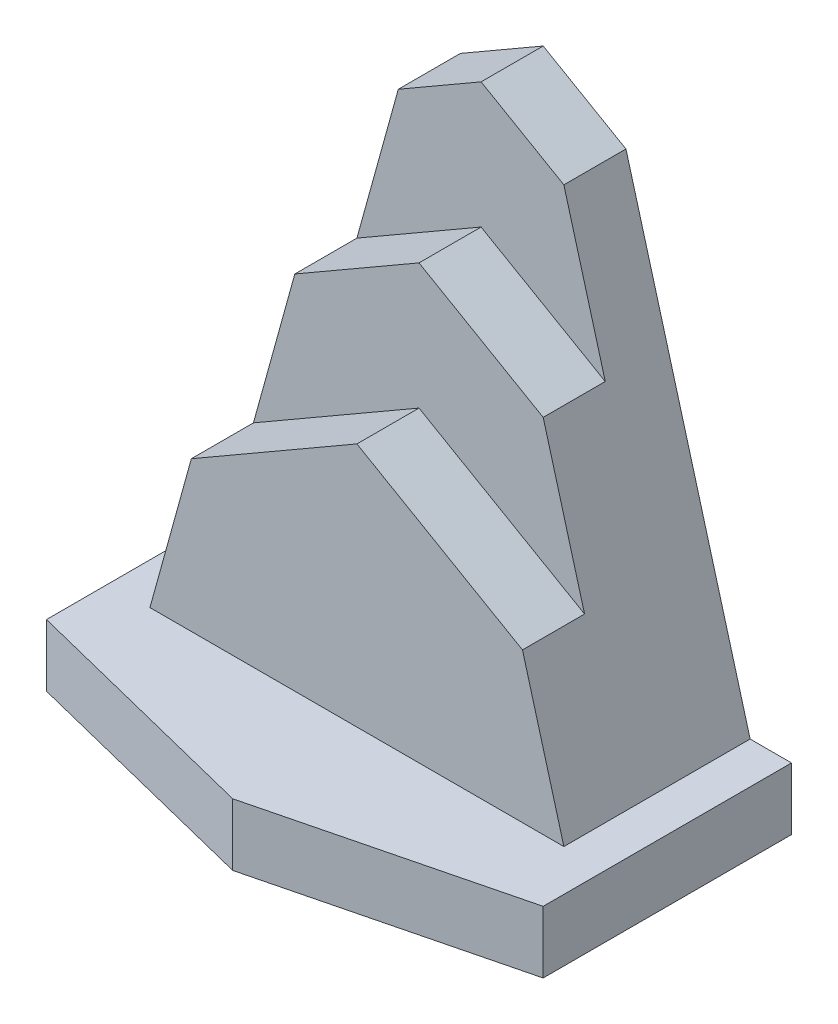
ISO-10303-21;
HEADER;
FILE_DESCRIPTION(('STEP AP214'),'2;1');
FILE_NAME('part.step','',(''),(''),'','','');
FILE_SCHEMA(('AUTOMOTIVE_DESIGN { 1 0 10303 214 1 1 1 1 }'));
ENDSEC;
DATA;
#1=APPLICATION_CONTEXT('core data for automotive mechanical design processes');
#2=APPLICATION_PROTOCOL_DEFINITION('international standard','automotive_design',2000,#1);
#3=PRODUCT_CONTEXT('',#1,'mechanical');
#4=PRODUCT('Part','Part','',(#3));
#5=PRODUCT_RELATED_PRODUCT_CATEGORY('part','',(#4));
#6=PRODUCT_DEFINITION_FORMATION('','',#4);
#7=PRODUCT_DEFINITION_CONTEXT('part definition',#1,'design');
#8=PRODUCT_DEFINITION('design','',#6,#7);
#9=PRODUCT_DEFINITION_SHAPE('','',#8);
#10=(LENGTH_UNIT() NAMED_UNIT(*) SI_UNIT(.MILLI.,.METRE.));
#11=(NAMED_UNIT(*) PLANE_ANGLE_UNIT() SI_UNIT($,.RADIAN.));
#12=(NAMED_UNIT(*) SI_UNIT($,.STERADIAN.) SOLID_ANGLE_UNIT());
#13=UNCERTAINTY_MEASURE_WITH_UNIT(LENGTH_MEASURE(1.E-05),#10,'distance_accuracy_value','');
#14=(GEOMETRIC_REPRESENTATION_CONTEXT(3) GLOBAL_UNCERTAINTY_ASSIGNED_CONTEXT((#13)) GLOBAL_UNIT_ASSIGNED_CONTEXT((#10,
#11,#12)) REPRESENTATION_CONTEXT('',''));
#15=CARTESIAN_POINT('',(0.,0.,0.));
#16=DIRECTION('',(0.,0.,1.));
#17=DIRECTION('',(1.,0.,0.));
#18=AXIS2_PLACEMENT_3D('',#15,#16,#17);
#19=CARTESIAN_POINT('',(0.,15.,-60.));
#20=DIRECTION('',(0.,1.,0.));
#21=DIRECTION('',(0.,0.,1.));
#22=AXIS2_PLACEMENT_3D('',#19,#20,#21);
#23=PLANE('',#22);
#24=DIRECTION('',(1.,0.,0.));
#25=VECTOR('',#24,1.);
#26=CARTESIAN_POINT('',(-110.,15.,-15.));
#27=LINE('',#26,#25);
#28=CARTESIAN_POINT('',(-110.,15.,-15.));
#29=VERTEX_POINT('',#28);
#30=CARTESIAN_POINT('',(-10.,15.,-15.));
#31=VERTEX_POINT('',#30);
#32=EDGE_CURVE('E161',#29,#31,#27,.T.);
#33=ORIENTED_EDGE('',*,*,#32,.F.);
#34=DIRECTION('',(0.,0.,-1.));
#35=VECTOR('',#34,1.);
#36=CARTESIAN_POINT('',(-110.,15.,-45.));
#37=LINE('',#36,#35);
#38=CARTESIAN_POINT('',(-110.,15.,-60.));
#39=VERTEX_POINT('',#38);
#40=EDGE_CURVE('E147',#29,#39,#37,.T.);
#41=ORIENTED_EDGE('',*,*,#40,.T.);
#42=DIRECTION('',(-1.,0.,0.));
#43=VECTOR('',#42,1.);
#44=CARTESIAN_POINT('',(-120.,15.,-60.));
#45=LINE('',#44,#43);
#46=CARTESIAN_POINT('',(-120.,15.,-60.));
#47=VERTEX_POINT('',#46);
#48=EDGE_CURVE('E251',#39,#47,#45,.T.);
#49=ORIENTED_EDGE('',*,*,#48,.T.);
#50=DIRECTION('',(0.,0.,1.));
#51=VECTOR('',#50,1.);
#52=CARTESIAN_POINT('',(-120.,15.,0.));
#53=LINE('',#52,#51);
#54=CARTESIAN_POINT('',(-120.,15.,0.));
#55=VERTEX_POINT('',#54);
#56=EDGE_CURVE('E250',#47,#55,#53,.T.);
#57=ORIENTED_EDGE('',*,*,#56,.T.);
#58=DIRECTION('',(0.970142500145332,0.,0.242535625036333));
#59=VECTOR('',#58,1.);
#60=CARTESIAN_POINT('',(-60.,15.,15.));
#61=LINE('',#60,#59);
#62=CARTESIAN_POINT('',(-60.,15.,15.));
#63=VERTEX_POINT('',#62);
#64=EDGE_CURVE('E253',#55,#63,#61,.T.);
#65=ORIENTED_EDGE('',*,*,#64,.T.);
#66=DIRECTION('',(0.970142500145332,0.,-0.242535625036333));
#67=VECTOR('',#66,1.);
#68=CARTESIAN_POINT('',(0.,15.,0.));
#69=LINE('',#68,#67);
#70=CARTESIAN_POINT('',(0.,15.,0.));
#71=VERTEX_POINT('',#70);
#72=EDGE_CURVE('E261',#63,#71,#69,.T.);
#73=ORIENTED_EDGE('',*,*,#72,.T.);
#74=DIRECTION('',(0.,0.,-1.));
#75=VECTOR('',#74,1.);
#76=CARTESIAN_POINT('',(0.,15.,-60.));
#77=LINE('',#76,#75);
#78=CARTESIAN_POINT('',(0.,15.,-60.));
#79=VERTEX_POINT('',#78);
#80=EDGE_CURVE('E231',#71,#79,#77,.T.);
#81=ORIENTED_EDGE('',*,*,#80,.T.);
#82=CARTESIAN_POINT('',(-9.99999999999999,15.,-60.));
#83=VERTEX_POINT('',#82);
#84=EDGE_CURVE('E244',#79,#83,#45,.T.);
#85=ORIENTED_EDGE('',*,*,#84,.T.);
#86=DIRECTION('',(0.,0.,-1.));
#87=VECTOR('',#86,1.);
#88=CARTESIAN_POINT('',(-9.99999999999999,15.,-45.));
#89=LINE('',#88,#87);
#90=EDGE_CURVE('E168',#31,#83,#89,.T.);
#91=ORIENTED_EDGE('',*,*,#90,.F.);
#92=EDGE_LOOP('',(#33,#41,#49,#57,#65,#73,#81,#85,#91));
#93=FACE_BOUND('',#92,.T.);
#94=ADVANCED_FACE('F33',(#93),#23,.T.);
#95=CARTESIAN_POINT('',(-60.,-46.6403925452972,-30.));
#96=DIRECTION('',(0.,0.,1.));
#97=DIRECTION('',(1.,0.,0.));
#98=AXIS2_PLACEMENT_3D('',#95,#96,#97);
#99=PLANE('',#98);
#100=DIRECTION('',(-0.866025403784438,-0.5,0.));
#101=VECTOR('',#100,1.);
#102=CARTESIAN_POINT('',(-60.0000000000001,74.2450089729875,-30.));
#103=LINE('',#102,#101);
#104=CARTESIAN_POINT('',(-60.0000000000001,74.2450089729875,-30.));
#105=VERTEX_POINT('',#104);
#106=CARTESIAN_POINT('',(-100.,51.1509982054026,-30.));
#107=VERTEX_POINT('',#106);
#108=EDGE_CURVE('E165',#105,#107,#103,.T.);
#109=ORIENTED_EDGE('',*,*,#108,.F.);
#110=DIRECTION('',(-0.866025403784439,0.5,0.));
#111=VECTOR('',#110,1.);
#112=CARTESIAN_POINT('',(-20.,51.1509982054024,-30.));
#113=LINE('',#112,#111);
#114=CARTESIAN_POINT('',(-20.,51.1509982054024,-30.));
#115=VERTEX_POINT('',#114);
#116=EDGE_CURVE('E177',#115,#105,#113,.T.);
#117=ORIENTED_EDGE('',*,*,#116,.F.);
#118=DIRECTION('',(-0.266605563289811,0.963805724004025,0.));
#119=VECTOR('',#118,1.);
#120=CARTESIAN_POINT('',(2.28494041244322,-29.4112858803711,-30.));
#121=LINE('',#120,#119);
#122=CARTESIAN_POINT('',(-30.,87.3019964108049,-30.));
#123=VERTEX_POINT('',#122);
#124=EDGE_CURVE('E195',#115,#123,#121,.T.);
#125=ORIENTED_EDGE('',*,*,#124,.T.);
#126=DIRECTION('',(0.866025403784439,-0.5,0.));
#127=VECTOR('',#126,1.);
#128=CARTESIAN_POINT('',(5.49875573978038,66.8067802285459,-30.));
#129=LINE('',#128,#127);
#130=CARTESIAN_POINT('',(-60.0000000000001,104.622504486494,-30.));
#131=VERTEX_POINT('',#130);
#132=EDGE_CURVE('E185',#131,#123,#129,.T.);
#133=ORIENTED_EDGE('',*,*,#132,.F.);
#134=DIRECTION('',(0.866025403784439,0.5,0.));
#135=VECTOR('',#134,1.);
#136=CARTESIAN_POINT('',(-125.49875573978,66.8067802285461,-30.));
#137=LINE('',#136,#135);
#138=CARTESIAN_POINT('',(-90.,87.301996410805,-30.));
#139=VERTEX_POINT('',#138);
#140=EDGE_CURVE('E188',#139,#131,#137,.T.);
#141=ORIENTED_EDGE('',*,*,#140,.F.);
#142=DIRECTION('',(-0.26660556328981,-0.963805724004025,0.));
#143=VECTOR('',#142,1.);
#144=CARTESIAN_POINT('',(-122.284940412443,-29.4112858803711,-30.));
#145=LINE('',#144,#143);
#146=EDGE_CURVE('E192',#139,#107,#145,.T.);
#147=ORIENTED_EDGE('',*,*,#146,.T.);
#148=EDGE_LOOP('',(#109,#117,#125,#133,#141,#147));
#149=FACE_BOUND('',#148,.T.);
#150=ADVANCED_FACE('F324',(#149),#99,.T.);
#151=CARTESIAN_POINT('',(0.,15.,-60.));
#152=DIRECTION('',(-1.,0.,0.));
#153=DIRECTION('',(0.,0.,1.));
#154=AXIS2_PLACEMENT_3D('',#151,#152,#153);
#155=PLANE('',#154);
#156=DIRECTION('',(0.,0.,-1.));
#157=VECTOR('',#156,1.);
#158=CARTESIAN_POINT('',(0.,0.,-60.));
#159=LINE('',#158,#157);
#160=CARTESIAN_POINT('',(0.,0.,0.));
#161=VERTEX_POINT('',#160);
#162=CARTESIAN_POINT('',(0.,0.,-60.));
#163=VERTEX_POINT('',#162);
#164=EDGE_CURVE('E238',#161,#163,#159,.T.);
#165=ORIENTED_EDGE('',*,*,#164,.T.);
#166=DIRECTION('',(0.,-1.,0.));
#167=VECTOR('',#166,1.);
#168=CARTESIAN_POINT('',(0.,15.,-60.));
#169=LINE('',#168,#167);
#170=EDGE_CURVE('E11',#79,#163,#169,.T.);
#171=ORIENTED_EDGE('',*,*,#170,.F.);
#172=ORIENTED_EDGE('',*,*,#80,.F.);
#173=DIRECTION('',(0.,-1.,0.));
#174=VECTOR('',#173,1.);
#175=CARTESIAN_POINT('',(0.,15.,0.));
#176=LINE('',#175,#174);
#177=EDGE_CURVE('E263',#71,#161,#176,.T.);
#178=ORIENTED_EDGE('',*,*,#177,.T.);
#179=EDGE_LOOP('',(#165,#171,#172,#178));
#180=FACE_BOUND('',#179,.T.);
#181=ADVANCED_FACE('F35',(#180),#155,.F.);
#182=CARTESIAN_POINT('',(-120.,15.,-60.));
#183=DIRECTION('',(0.,0.,1.));
#184=DIRECTION('',(1.,0.,0.));
#185=AXIS2_PLACEMENT_3D('',#182,#183,#184);
#186=PLANE('',#185);
#187=DIRECTION('',(-1.,0.,0.));
#188=VECTOR('',#187,1.);
#189=CARTESIAN_POINT('',(-120.,0.,-60.));
#190=LINE('',#189,#188);
#191=CARTESIAN_POINT('',(-120.,0.,-60.));
#192=VERTEX_POINT('',#191);
#193=EDGE_CURVE('E266',#163,#192,#190,.T.);
#194=ORIENTED_EDGE('',*,*,#193,.T.);
#195=DIRECTION('',(0.,-1.,0.));
#196=VECTOR('',#195,1.);
#197=CARTESIAN_POINT('',(-120.,15.,-60.));
#198=LINE('',#197,#196);
#199=EDGE_CURVE('E42',#47,#192,#198,.T.);
#200=ORIENTED_EDGE('',*,*,#199,.F.);
#201=ORIENTED_EDGE('',*,*,#48,.F.);
#202=DIRECTION('',(0.26660556328981,0.963805724004025,0.));
#203=VECTOR('',#202,1.);
#204=CARTESIAN_POINT('',(-110.,15.,-60.));
#205=LINE('',#204,#203);
#206=CARTESIAN_POINT('',(-80.,123.452994616208,-60.));
#207=VERTEX_POINT('',#206);
#208=EDGE_CURVE('E58',#39,#207,#205,.T.);
#209=ORIENTED_EDGE('',*,*,#208,.T.);
#210=DIRECTION('',(0.86602540378444,0.499999999999998,0.));
#211=VECTOR('',#210,1.);
#212=CARTESIAN_POINT('',(-80.,123.452994616208,-60.));
#213=LINE('',#212,#211);
#214=CARTESIAN_POINT('',(-60.,135.,-60.));
#215=VERTEX_POINT('',#214);
#216=EDGE_CURVE('E218',#207,#215,#213,.T.);
#217=ORIENTED_EDGE('',*,*,#216,.T.);
#218=DIRECTION('',(0.866025403784436,-0.500000000000004,0.));
#219=VECTOR('',#218,1.);
#220=CARTESIAN_POINT('',(-60.,135.,-60.));
#221=LINE('',#220,#219);
#222=CARTESIAN_POINT('',(-40.,123.452994616207,-60.));
#223=VERTEX_POINT('',#222);
#224=EDGE_CURVE('E221',#215,#223,#221,.T.);
#225=ORIENTED_EDGE('',*,*,#224,.T.);
#226=DIRECTION('',(0.266605563289811,-0.963805724004025,0.));
#227=VECTOR('',#226,1.);
#228=CARTESIAN_POINT('',(-40.,123.452994616207,-60.));
#229=LINE('',#228,#227);
#230=EDGE_CURVE('E210',#223,#83,#229,.T.);
#231=ORIENTED_EDGE('',*,*,#230,.T.);
#232=ORIENTED_EDGE('',*,*,#84,.F.);
#233=ORIENTED_EDGE('',*,*,#170,.T.);
#234=EDGE_LOOP('',(#194,#200,#201,#209,#217,#225,#231,#232,#233));
#235=FACE_BOUND('',#234,.T.);
#236=ADVANCED_FACE('F243',(#235),#186,.F.);
#237=CARTESIAN_POINT('',(-120.,15.,0.));
#238=DIRECTION('',(1.,0.,0.));
#239=DIRECTION('',(0.,0.,-1.));
#240=AXIS2_PLACEMENT_3D('',#237,#238,#239);
#241=PLANE('',#240);
#242=DIRECTION('',(0.,0.,1.));
#243=VECTOR('',#242,1.);
#244=CARTESIAN_POINT('',(-120.,0.,0.));
#245=LINE('',#244,#243);
#246=CARTESIAN_POINT('',(-120.,0.,0.));
#247=VERTEX_POINT('',#246);
#248=EDGE_CURVE('E268',#192,#247,#245,.T.);
#249=ORIENTED_EDGE('',*,*,#248,.T.);
#250=DIRECTION('',(0.,-1.,0.));
#251=VECTOR('',#250,1.);
#252=CARTESIAN_POINT('',(-120.,15.,0.));
#253=LINE('',#252,#251);
#254=EDGE_CURVE('E279',#55,#247,#253,.T.);
#255=ORIENTED_EDGE('',*,*,#254,.F.);
#256=ORIENTED_EDGE('',*,*,#56,.F.);
#257=ORIENTED_EDGE('',*,*,#199,.T.);
#258=EDGE_LOOP('',(#249,#255,#256,#257));
#259=FACE_BOUND('',#258,.T.);
#260=ADVANCED_FACE('F286',(#259),#241,.F.);
#261=CARTESIAN_POINT('',(-60.,15.,15.));
#262=DIRECTION('',(0.242535625036333,0.,-0.970142500145332));
#263=DIRECTION('',(-0.970142500145332,0.,-0.242535625036333));
#264=AXIS2_PLACEMENT_3D('',#261,#262,#263);
#265=PLANE('',#264);
#266=DIRECTION('',(0.970142500145332,0.,0.242535625036333));
#267=VECTOR('',#266,1.);
#268=CARTESIAN_POINT('',(-60.,0.,15.));
#269=LINE('',#268,#267);
#270=CARTESIAN_POINT('',(-60.,0.,15.));
#271=VERTEX_POINT('',#270);
#272=EDGE_CURVE('E270',#247,#271,#269,.T.);
#273=ORIENTED_EDGE('',*,*,#272,.T.);
#274=DIRECTION('',(0.,-1.,0.));
#275=VECTOR('',#274,1.);
#276=CARTESIAN_POINT('',(-60.,15.,15.));
#277=LINE('',#276,#275);
#278=EDGE_CURVE('E276',#63,#271,#277,.T.);
#279=ORIENTED_EDGE('',*,*,#278,.F.);
#280=ORIENTED_EDGE('',*,*,#64,.F.);
#281=ORIENTED_EDGE('',*,*,#254,.T.);
#282=EDGE_LOOP('',(#273,#279,#280,#281));
#283=FACE_BOUND('',#282,.T.);
#284=ADVANCED_FACE('F295',(#283),#265,.F.);
#285=CARTESIAN_POINT('',(0.,15.,0.));
#286=DIRECTION('',(-0.242535625036333,0.,-0.970142500145332));
#287=DIRECTION('',(-0.970142500145332,0.,0.242535625036333));
#288=AXIS2_PLACEMENT_3D('',#285,#286,#287);
#289=PLANE('',#288);
#290=DIRECTION('',(0.970142500145332,0.,-0.242535625036333));
#291=VECTOR('',#290,1.);
#292=CARTESIAN_POINT('',(0.,0.,0.));
#293=LINE('',#292,#291);
#294=EDGE_CURVE('E272',#271,#161,#293,.T.);
#295=ORIENTED_EDGE('',*,*,#294,.T.);
#296=ORIENTED_EDGE('',*,*,#177,.F.);
#297=ORIENTED_EDGE('',*,*,#72,.F.);
#298=ORIENTED_EDGE('',*,*,#278,.T.);
#299=EDGE_LOOP('',(#295,#296,#297,#298));
#300=FACE_BOUND('',#299,.T.);
#301=ADVANCED_FACE('F299',(#300),#289,.F.);
#302=CARTESIAN_POINT('',(0.,0.,-60.));
#303=DIRECTION('',(0.,1.,0.));
#304=DIRECTION('',(0.,0.,1.));
#305=AXIS2_PLACEMENT_3D('',#302,#303,#304);
#306=PLANE('',#305);
#307=ORIENTED_EDGE('',*,*,#164,.F.);
#308=ORIENTED_EDGE('',*,*,#294,.F.);
#309=ORIENTED_EDGE('',*,*,#272,.F.);
#310=ORIENTED_EDGE('',*,*,#248,.F.);
#311=ORIENTED_EDGE('',*,*,#193,.F.);
#312=EDGE_LOOP('',(#307,#308,#309,#310,#311));
#313=FACE_BOUND('',#312,.T.);
#314=ADVANCED_FACE('F291',(#313),#306,.F.);
#315=CARTESIAN_POINT('',(-40.,123.452994616207,-45.));
#316=DIRECTION('',(0.963805724004025,0.266605563289811,0.));
#317=DIRECTION('',(-0.266605563289811,0.963805724004025,0.));
#318=AXIS2_PLACEMENT_3D('',#315,#316,#317);
#319=PLANE('',#318);
#320=ORIENTED_EDGE('',*,*,#230,.F.);
#321=DIRECTION('',(0.,0.,-1.));
#322=VECTOR('',#321,1.);
#323=CARTESIAN_POINT('',(-40.,123.452994616207,-45.));
#324=LINE('',#323,#322);
#325=CARTESIAN_POINT('',(-40.,123.452994616207,-45.));
#326=VERTEX_POINT('',#325);
#327=EDGE_CURVE('E224',#326,#223,#324,.T.);
#328=ORIENTED_EDGE('',*,*,#327,.F.);
#329=DIRECTION('',(0.266605563289811,-0.963805724004025,0.));
#330=VECTOR('',#329,1.);
#331=CARTESIAN_POINT('',(-40.,123.452994616207,-45.));
#332=LINE('',#331,#330);
#333=CARTESIAN_POINT('',(-30.,87.3019964108049,-45.));
#334=VERTEX_POINT('',#333);
#335=EDGE_CURVE('E156',#326,#334,#332,.T.);
#336=ORIENTED_EDGE('',*,*,#335,.T.);
#337=DIRECTION('',(0.,0.,-1.));
#338=VECTOR('',#337,1.);
#339=CARTESIAN_POINT('',(-30.,87.3019964108049,-30.));
#340=LINE('',#339,#338);
#341=EDGE_CURVE('E197',#123,#334,#340,.T.);
#342=ORIENTED_EDGE('',*,*,#341,.F.);
#343=ORIENTED_EDGE('',*,*,#124,.F.);
#344=DIRECTION('',(0.,0.,-1.));
#345=VECTOR('',#344,1.);
#346=CARTESIAN_POINT('',(-20.,51.1509982054024,-15.));
#347=LINE('',#346,#345);
#348=CARTESIAN_POINT('',(-20.,51.1509982054024,-15.));
#349=VERTEX_POINT('',#348);
#350=EDGE_CURVE('E182',#349,#115,#347,.T.);
#351=ORIENTED_EDGE('',*,*,#350,.F.);
#352=DIRECTION('',(-0.26660556328981,0.963805724004025,0.));
#353=VECTOR('',#352,1.);
#354=CARTESIAN_POINT('',(-10.,15.,-15.));
#355=LINE('',#354,#353);
#356=EDGE_CURVE('E169',#31,#349,#355,.T.);
#357=ORIENTED_EDGE('',*,*,#356,.F.);
#358=ORIENTED_EDGE('',*,*,#90,.T.);
#359=EDGE_LOOP('',(#320,#328,#336,#342,#343,#351,#357,#358));
#360=FACE_BOUND('',#359,.T.);
#361=ADVANCED_FACE('F310',(#360),#319,.T.);
#362=CARTESIAN_POINT('',(-60.,135.,-45.));
#363=DIRECTION('',(0.500000000000004,0.866025403784436,0.));
#364=DIRECTION('',(-0.866025403784436,0.500000000000004,0.));
#365=AXIS2_PLACEMENT_3D('',#362,#363,#364);
#366=PLANE('',#365);
#367=ORIENTED_EDGE('',*,*,#224,.F.);
#368=DIRECTION('',(0.,0.,-1.));
#369=VECTOR('',#368,1.);
#370=CARTESIAN_POINT('',(-60.,135.,-45.));
#371=LINE('',#370,#369);
#372=CARTESIAN_POINT('',(-60.,135.,-45.));
#373=VERTEX_POINT('',#372);
#374=EDGE_CURVE('E226',#373,#215,#371,.T.);
#375=ORIENTED_EDGE('',*,*,#374,.F.);
#376=DIRECTION('',(0.866025403784436,-0.500000000000004,0.));
#377=VECTOR('',#376,1.);
#378=CARTESIAN_POINT('',(-60.,135.,-45.));
#379=LINE('',#378,#377);
#380=EDGE_CURVE('E213',#373,#326,#379,.T.);
#381=ORIENTED_EDGE('',*,*,#380,.T.);
#382=ORIENTED_EDGE('',*,*,#327,.T.);
#383=EDGE_LOOP('',(#367,#375,#381,#382));
#384=FACE_BOUND('',#383,.T.);
#385=ADVANCED_FACE('F308',(#384),#366,.T.);
#386=CARTESIAN_POINT('',(-80.,123.452994616208,-45.));
#387=DIRECTION('',(-0.499999999999998,0.86602540378444,0.));
#388=DIRECTION('',(-0.86602540378444,-0.499999999999998,0.));
#389=AXIS2_PLACEMENT_3D('',#386,#387,#388);
#390=PLANE('',#389);
#391=ORIENTED_EDGE('',*,*,#216,.F.);
#392=DIRECTION('',(0.,0.,-1.));
#393=VECTOR('',#392,1.);
#394=CARTESIAN_POINT('',(-80.,123.452994616208,-45.));
#395=LINE('',#394,#393);
#396=CARTESIAN_POINT('',(-80.,123.452994616208,-45.));
#397=VERTEX_POINT('',#396);
#398=EDGE_CURVE('E155',#397,#207,#395,.T.);
#399=ORIENTED_EDGE('',*,*,#398,.F.);
#400=DIRECTION('',(0.86602540378444,0.499999999999998,0.));
#401=VECTOR('',#400,1.);
#402=CARTESIAN_POINT('',(-80.,123.452994616208,-45.));
#403=LINE('',#402,#401);
#404=EDGE_CURVE('E209',#397,#373,#403,.T.);
#405=ORIENTED_EDGE('',*,*,#404,.T.);
#406=ORIENTED_EDGE('',*,*,#374,.T.);
#407=EDGE_LOOP('',(#391,#399,#405,#406));
#408=FACE_BOUND('',#407,.T.);
#409=ADVANCED_FACE('F304',(#408),#390,.T.);
#410=CARTESIAN_POINT('',(-110.,15.,-45.));
#411=DIRECTION('',(-0.963805724004025,0.26660556328981,0.));
#412=DIRECTION('',(-0.26660556328981,-0.963805724004025,0.));
#413=AXIS2_PLACEMENT_3D('',#410,#411,#412);
#414=PLANE('',#413);
#415=ORIENTED_EDGE('',*,*,#208,.F.);
#416=ORIENTED_EDGE('',*,*,#40,.F.);
#417=DIRECTION('',(-0.26660556328981,-0.963805724004025,0.));
#418=VECTOR('',#417,1.);
#419=CARTESIAN_POINT('',(-100.,51.1509982054026,-15.));
#420=LINE('',#419,#418);
#421=CARTESIAN_POINT('',(-100.,51.1509982054026,-15.));
#422=VERTEX_POINT('',#421);
#423=EDGE_CURVE('E151',#422,#29,#420,.T.);
#424=ORIENTED_EDGE('',*,*,#423,.F.);
#425=DIRECTION('',(0.,0.,-1.));
#426=VECTOR('',#425,1.);
#427=CARTESIAN_POINT('',(-100.,51.1509982054026,-15.));
#428=LINE('',#427,#426);
#429=EDGE_CURVE('E176',#422,#107,#428,.T.);
#430=ORIENTED_EDGE('',*,*,#429,.T.);
#431=ORIENTED_EDGE('',*,*,#146,.F.);
#432=DIRECTION('',(0.,0.,-1.));
#433=VECTOR('',#432,1.);
#434=CARTESIAN_POINT('',(-90.,87.301996410805,-30.));
#435=LINE('',#434,#433);
#436=CARTESIAN_POINT('',(-90.,87.301996410805,-45.));
#437=VERTEX_POINT('',#436);
#438=EDGE_CURVE('E203',#139,#437,#435,.T.);
#439=ORIENTED_EDGE('',*,*,#438,.T.);
#440=DIRECTION('',(0.26660556328981,0.963805724004025,0.));
#441=VECTOR('',#440,1.);
#442=CARTESIAN_POINT('',(-110.,15.,-45.));
#443=LINE('',#442,#441);
#444=EDGE_CURVE('E207',#437,#397,#443,.T.);
#445=ORIENTED_EDGE('',*,*,#444,.T.);
#446=ORIENTED_EDGE('',*,*,#398,.T.);
#447=EDGE_LOOP('',(#415,#416,#424,#430,#431,#439,#445,#446));
#448=FACE_BOUND('',#447,.T.);
#449=ADVANCED_FACE('F149',(#448),#414,.T.);
#450=CARTESIAN_POINT('',(-9.99999999999998,15.,-45.));
#451=DIRECTION('',(0.,0.,-1.));
#452=DIRECTION('',(-1.,0.,0.));
#453=AXIS2_PLACEMENT_3D('',#450,#451,#452);
#454=PLANE('',#453);
#455=DIRECTION('',(0.866025403784439,0.5,0.));
#456=VECTOR('',#455,1.);
#457=CARTESIAN_POINT('',(-125.49875573978,66.8067802285461,-45.));
#458=LINE('',#457,#456);
#459=CARTESIAN_POINT('',(-60.0000000000001,104.622504486494,-45.));
#460=VERTEX_POINT('',#459);
#461=EDGE_CURVE('E189',#437,#460,#458,.T.);
#462=ORIENTED_EDGE('',*,*,#461,.T.);
#463=DIRECTION('',(0.866025403784439,-0.5,0.));
#464=VECTOR('',#463,1.);
#465=CARTESIAN_POINT('',(5.49875573978038,66.8067802285459,-45.));
#466=LINE('',#465,#464);
#467=EDGE_CURVE('E184',#460,#334,#466,.T.);
#468=ORIENTED_EDGE('',*,*,#467,.T.);
#469=ORIENTED_EDGE('',*,*,#335,.F.);
#470=ORIENTED_EDGE('',*,*,#380,.F.);
#471=ORIENTED_EDGE('',*,*,#404,.F.);
#472=ORIENTED_EDGE('',*,*,#444,.F.);
#473=EDGE_LOOP('',(#462,#468,#469,#470,#471,#472));
#474=FACE_BOUND('',#473,.T.);
#475=ADVANCED_FACE('F314',(#474),#454,.F.);
#476=CARTESIAN_POINT('',(5.49875573978038,66.8067802285459,-30.));
#477=DIRECTION('',(0.5,0.866025403784439,0.));
#478=DIRECTION('',(-0.866025403784439,0.5,0.));
#479=AXIS2_PLACEMENT_3D('',#476,#477,#478);
#480=PLANE('',#479);
#481=ORIENTED_EDGE('',*,*,#467,.F.);
#482=DIRECTION('',(0.,0.,-1.));
#483=VECTOR('',#482,1.);
#484=CARTESIAN_POINT('',(-60.0000000000001,104.622504486494,-30.));
#485=LINE('',#484,#483);
#486=EDGE_CURVE('E205',#131,#460,#485,.T.);
#487=ORIENTED_EDGE('',*,*,#486,.F.);
#488=ORIENTED_EDGE('',*,*,#132,.T.);
#489=ORIENTED_EDGE('',*,*,#341,.T.);
#490=EDGE_LOOP('',(#481,#487,#488,#489));
#491=FACE_BOUND('',#490,.T.);
#492=ADVANCED_FACE('F319',(#491),#480,.T.);
#493=CARTESIAN_POINT('',(-125.49875573978,66.8067802285461,-30.));
#494=DIRECTION('',(-0.5,0.866025403784439,0.));
#495=DIRECTION('',(-0.866025403784439,-0.5,0.));
#496=AXIS2_PLACEMENT_3D('',#493,#494,#495);
#497=PLANE('',#496);
#498=ORIENTED_EDGE('',*,*,#461,.F.);
#499=ORIENTED_EDGE('',*,*,#438,.F.);
#500=ORIENTED_EDGE('',*,*,#140,.T.);
#501=ORIENTED_EDGE('',*,*,#486,.T.);
#502=EDGE_LOOP('',(#498,#499,#500,#501));
#503=FACE_BOUND('',#502,.T.);
#504=ADVANCED_FACE('F327',(#503),#497,.T.);
#505=CARTESIAN_POINT('',(-20.,51.1509982054024,-15.));
#506=DIRECTION('',(-0.5,-0.866025403784439,0.));
#507=DIRECTION('',(0.866025403784439,-0.5,0.));
#508=AXIS2_PLACEMENT_3D('',#505,#506,#507);
#509=PLANE('',#508);
#510=ORIENTED_EDGE('',*,*,#116,.T.);
#511=DIRECTION('',(0.,0.,-1.));
#512=VECTOR('',#511,1.);
#513=CARTESIAN_POINT('',(-60.0000000000001,74.2450089729875,-15.));
#514=LINE('',#513,#512);
#515=CARTESIAN_POINT('',(-60.0000000000001,74.2450089729875,-15.));
#516=VERTEX_POINT('',#515);
#517=EDGE_CURVE('E50',#516,#105,#514,.T.);
#518=ORIENTED_EDGE('',*,*,#517,.F.);
#519=DIRECTION('',(-0.866025403784439,0.5,0.));
#520=VECTOR('',#519,1.);
#521=CARTESIAN_POINT('',(-20.,51.1509982054024,-15.));
#522=LINE('',#521,#520);
#523=EDGE_CURVE('E171',#349,#516,#522,.T.);
#524=ORIENTED_EDGE('',*,*,#523,.F.);
#525=ORIENTED_EDGE('',*,*,#350,.T.);
#526=EDGE_LOOP('',(#510,#518,#524,#525));
#527=FACE_BOUND('',#526,.T.);
#528=ADVANCED_FACE('F331',(#527),#509,.F.);
#529=CARTESIAN_POINT('',(-60.0000000000001,74.2450089729875,-15.));
#530=DIRECTION('',(0.5,-0.866025403784438,0.));
#531=DIRECTION('',(0.866025403784438,0.5,0.));
#532=AXIS2_PLACEMENT_3D('',#529,#530,#531);
#533=PLANE('',#532);
#534=ORIENTED_EDGE('',*,*,#108,.T.);
#535=ORIENTED_EDGE('',*,*,#429,.F.);
#536=DIRECTION('',(-0.866025403784438,-0.5,0.));
#537=VECTOR('',#536,1.);
#538=CARTESIAN_POINT('',(-60.0000000000001,74.2450089729875,-15.));
#539=LINE('',#538,#537);
#540=EDGE_CURVE('E163',#516,#422,#539,.T.);
#541=ORIENTED_EDGE('',*,*,#540,.F.);
#542=ORIENTED_EDGE('',*,*,#517,.T.);
#543=EDGE_LOOP('',(#534,#535,#541,#542));
#544=FACE_BOUND('',#543,.T.);
#545=ADVANCED_FACE('F329',(#544),#533,.F.);
#546=CARTESIAN_POINT('',(-88.9830479679853,90.9783795192396,-15.));
#547=DIRECTION('',(0.,0.,-1.));
#548=DIRECTION('',(-1.,0.,0.));
#549=AXIS2_PLACEMENT_3D('',#546,#547,#548);
#550=PLANE('',#549);
#551=ORIENTED_EDGE('',*,*,#423,.T.);
#552=ORIENTED_EDGE('',*,*,#32,.T.);
#553=ORIENTED_EDGE('',*,*,#356,.T.);
#554=ORIENTED_EDGE('',*,*,#523,.T.);
#555=ORIENTED_EDGE('',*,*,#540,.T.);
#556=EDGE_LOOP('',(#551,#552,#553,#554,#555));
#557=FACE_BOUND('',#556,.T.);
#558=ADVANCED_FACE('F160',(#557),#550,.F.);
#559=CLOSED_SHELL('',(#94,#150,#181,#236,#260,#284,#301,#314,#361,#385,#409,#449,#475,#492,#504,
#528,#545,#558));
#560=MANIFOLD_SOLID_BREP('B2',#559);
#561=ADVANCED_BREP_SHAPE_REPRESENTATION('',(#18,#560),#14);
#562=SHAPE_DEFINITION_REPRESENTATION(#9,#561);
ENDSEC;
END-ISO-10303-21;
